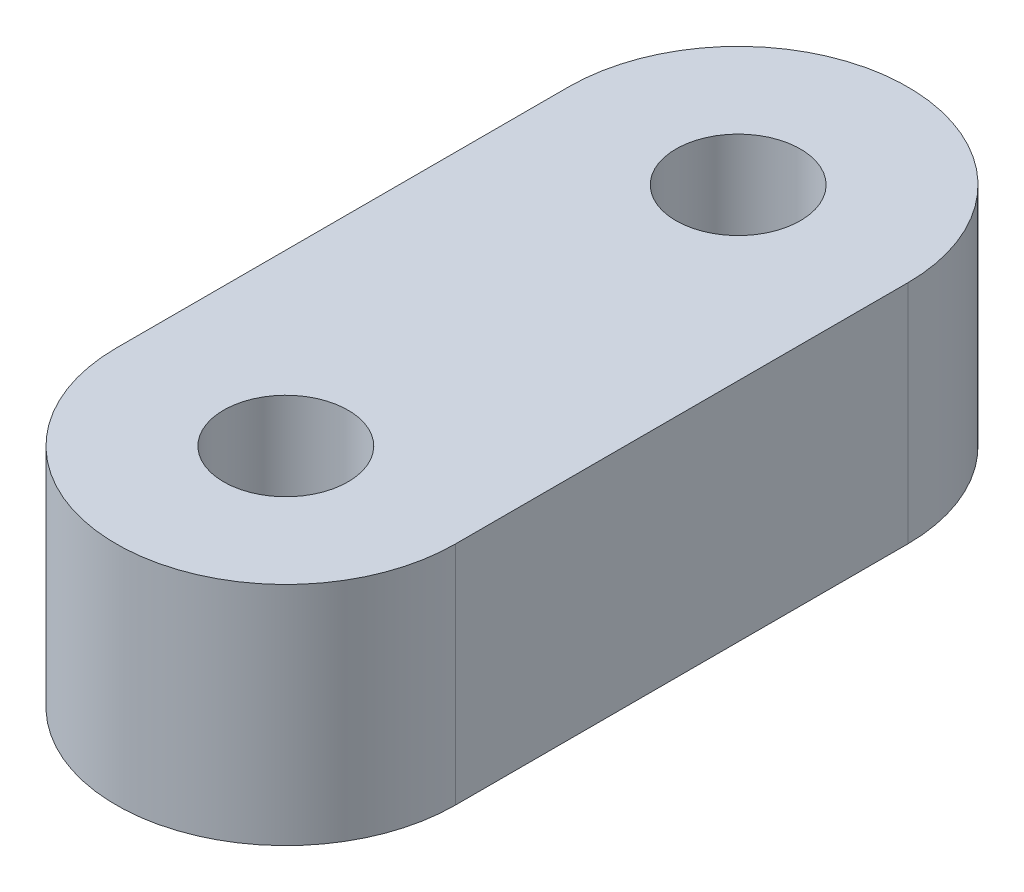
ISO-10303-21;
HEADER;
FILE_DESCRIPTION(('STEP AP214'),'2;1');
FILE_NAME('part.step','',(''),(''),'','','');
FILE_SCHEMA(('AUTOMOTIVE_DESIGN { 1 0 10303 214 1 1 1 1 }'));
ENDSEC;
DATA;
#1=APPLICATION_CONTEXT('core data for automotive mechanical design processes');
#2=APPLICATION_PROTOCOL_DEFINITION('international standard','automotive_design',2000,#1);
#3=PRODUCT_CONTEXT('',#1,'mechanical');
#4=PRODUCT('Part','Part','',(#3));
#5=PRODUCT_RELATED_PRODUCT_CATEGORY('part','',(#4));
#6=PRODUCT_DEFINITION_FORMATION('','',#4);
#7=PRODUCT_DEFINITION_CONTEXT('part definition',#1,'design');
#8=PRODUCT_DEFINITION('design','',#6,#7);
#9=PRODUCT_DEFINITION_SHAPE('','',#8);
#10=(LENGTH_UNIT() NAMED_UNIT(*) SI_UNIT(.MILLI.,.METRE.));
#11=(NAMED_UNIT(*) PLANE_ANGLE_UNIT() SI_UNIT($,.RADIAN.));
#12=(NAMED_UNIT(*) SI_UNIT($,.STERADIAN.) SOLID_ANGLE_UNIT());
#13=UNCERTAINTY_MEASURE_WITH_UNIT(LENGTH_MEASURE(1.E-05),#10,'distance_accuracy_value','');
#14=(GEOMETRIC_REPRESENTATION_CONTEXT(3) GLOBAL_UNCERTAINTY_ASSIGNED_CONTEXT((#13)) GLOBAL_UNIT_ASSIGNED_CONTEXT((#10,
#11,#12)) REPRESENTATION_CONTEXT('',''));
#15=CARTESIAN_POINT('',(0.,0.,0.));
#16=DIRECTION('',(0.,0.,1.));
#17=DIRECTION('',(1.,0.,0.));
#18=AXIS2_PLACEMENT_3D('',#15,#16,#17);
#19=CARTESIAN_POINT('',(-7.5,10.,0.));
#20=DIRECTION('',(1.,0.,0.));
#21=DIRECTION('',(0.,0.,-1.));
#22=AXIS2_PLACEMENT_3D('',#19,#20,#21);
#23=PLANE('',#22);
#24=DIRECTION('',(0.,0.,1.));
#25=VECTOR('',#24,1.);
#26=CARTESIAN_POINT('',(-7.5,0.,0.));
#27=LINE('',#26,#25);
#28=CARTESIAN_POINT('',(-7.5,0.,-20.));
#29=VERTEX_POINT('',#28);
#30=CARTESIAN_POINT('',(-7.5,0.,0.));
#31=VERTEX_POINT('',#30);
#32=EDGE_CURVE('E102',#29,#31,#27,.T.);
#33=ORIENTED_EDGE('',*,*,#32,.T.);
#34=DIRECTION('',(0.,-1.,0.));
#35=VECTOR('',#34,1.);
#36=CARTESIAN_POINT('',(-7.5,10.,0.));
#37=LINE('',#36,#35);
#38=CARTESIAN_POINT('',(-7.5,10.,0.));
#39=VERTEX_POINT('',#38);
#40=EDGE_CURVE('E11',#39,#31,#37,.T.);
#41=ORIENTED_EDGE('',*,*,#40,.F.);
#42=DIRECTION('',(0.,0.,1.));
#43=VECTOR('',#42,1.);
#44=CARTESIAN_POINT('',(-7.5,10.,0.));
#45=LINE('',#44,#43);
#46=CARTESIAN_POINT('',(-7.5,10.,-20.));
#47=VERTEX_POINT('',#46);
#48=EDGE_CURVE('E81',#47,#39,#45,.T.);
#49=ORIENTED_EDGE('',*,*,#48,.F.);
#50=DIRECTION('',(0.,-1.,0.));
#51=VECTOR('',#50,1.);
#52=CARTESIAN_POINT('',(-7.5,10.,-20.));
#53=LINE('',#52,#51);
#54=EDGE_CURVE('E92',#47,#29,#53,.T.);
#55=ORIENTED_EDGE('',*,*,#54,.T.);
#56=EDGE_LOOP('',(#33,#41,#49,#55));
#57=FACE_BOUND('',#56,.T.);
#58=ADVANCED_FACE('F33',(#57),#23,.F.);
#59=CARTESIAN_POINT('',(0.,10.,0.));
#60=DIRECTION('',(0.,-1.,0.));
#61=DIRECTION('',(0.,0.,-1.));
#62=AXIS2_PLACEMENT_3D('',#59,#60,#61);
#63=CYLINDRICAL_SURFACE('',#62,7.5);
#64=CARTESIAN_POINT('',(0.,0.,0.));
#65=DIRECTION('',(0.,1.,0.));
#66=DIRECTION('',(0.,0.,1.));
#67=AXIS2_PLACEMENT_3D('',#64,#65,#66);
#68=CIRCLE('',#67,7.5);
#69=CARTESIAN_POINT('',(7.5,0.,0.));
#70=VERTEX_POINT('',#69);
#71=EDGE_CURVE('E86',#31,#70,#68,.T.);
#72=ORIENTED_EDGE('',*,*,#71,.T.);
#73=DIRECTION('',(0.,-1.,0.));
#74=VECTOR('',#73,1.);
#75=CARTESIAN_POINT('',(7.5,10.,0.));
#76=LINE('',#75,#74);
#77=CARTESIAN_POINT('',(7.5,10.,0.));
#78=VERTEX_POINT('',#77);
#79=EDGE_CURVE('E42',#78,#70,#76,.T.);
#80=ORIENTED_EDGE('',*,*,#79,.F.);
#81=CARTESIAN_POINT('',(0.,10.,0.));
#82=DIRECTION('',(0.,1.,0.));
#83=DIRECTION('',(0.,0.,1.));
#84=AXIS2_PLACEMENT_3D('',#81,#82,#83);
#85=CIRCLE('',#84,7.5);
#86=EDGE_CURVE('E76',#39,#78,#85,.T.);
#87=ORIENTED_EDGE('',*,*,#86,.F.);
#88=ORIENTED_EDGE('',*,*,#40,.T.);
#89=EDGE_LOOP('',(#72,#80,#87,#88));
#90=FACE_BOUND('',#89,.T.);
#91=ADVANCED_FACE('F85',(#90),#63,.T.);
#92=CARTESIAN_POINT('',(7.5,10.,0.));
#93=DIRECTION('',(1.,0.,0.));
#94=DIRECTION('',(0.,0.,-1.));
#95=AXIS2_PLACEMENT_3D('',#92,#93,#94);
#96=PLANE('',#95);
#97=DIRECTION('',(0.,0.,1.));
#98=VECTOR('',#97,1.);
#99=CARTESIAN_POINT('',(7.5,0.,0.));
#100=LINE('',#99,#98);
#101=CARTESIAN_POINT('',(7.5,0.,-20.));
#102=VERTEX_POINT('',#101);
#103=EDGE_CURVE('E106',#102,#70,#100,.T.);
#104=ORIENTED_EDGE('',*,*,#103,.F.);
#105=DIRECTION('',(0.,-1.,0.));
#106=VECTOR('',#105,1.);
#107=CARTESIAN_POINT('',(7.5,10.,-20.));
#108=LINE('',#107,#106);
#109=CARTESIAN_POINT('',(7.5,10.,-20.));
#110=VERTEX_POINT('',#109);
#111=EDGE_CURVE('E66',#110,#102,#108,.T.);
#112=ORIENTED_EDGE('',*,*,#111,.F.);
#113=DIRECTION('',(0.,0.,1.));
#114=VECTOR('',#113,1.);
#115=CARTESIAN_POINT('',(7.5,10.,0.));
#116=LINE('',#115,#114);
#117=EDGE_CURVE('E79',#110,#78,#116,.T.);
#118=ORIENTED_EDGE('',*,*,#117,.T.);
#119=ORIENTED_EDGE('',*,*,#79,.T.);
#120=EDGE_LOOP('',(#104,#112,#118,#119));
#121=FACE_BOUND('',#120,.T.);
#122=ADVANCED_FACE('F90',(#121),#96,.T.);
#123=CARTESIAN_POINT('',(0.,10.,0.));
#124=DIRECTION('',(0.,-1.,0.));
#125=DIRECTION('',(0.,0.,-1.));
#126=AXIS2_PLACEMENT_3D('',#123,#124,#125);
#127=CYLINDRICAL_SURFACE('',#126,2.75);
#128=CARTESIAN_POINT('',(0.,10.,0.));
#129=DIRECTION('',(0.,1.,0.));
#130=DIRECTION('',(0.,0.,1.));
#131=AXIS2_PLACEMENT_3D('',#128,#129,#130);
#132=CIRCLE('',#131,2.75);
#133=CARTESIAN_POINT('',(0.,10.,2.75));
#134=VERTEX_POINT('',#133);
#135=EDGE_CURVE('E144',#134,#134,#132,.T.);
#136=ORIENTED_EDGE('',*,*,#135,.T.);
#137=EDGE_LOOP('',(#136));
#138=FACE_BOUND('',#137,.T.);
#139=CARTESIAN_POINT('',(0.,0.,0.));
#140=DIRECTION('',(0.,1.,0.));
#141=DIRECTION('',(0.,0.,1.));
#142=AXIS2_PLACEMENT_3D('',#139,#140,#141);
#143=CIRCLE('',#142,2.75);
#144=CARTESIAN_POINT('',(0.,0.,2.75));
#145=VERTEX_POINT('',#144);
#146=EDGE_CURVE('E99',#145,#145,#143,.T.);
#147=ORIENTED_EDGE('',*,*,#146,.F.);
#148=EDGE_LOOP('',(#147));
#149=FACE_BOUND('',#148,.T.);
#150=ADVANCED_FACE('F133',(#138,#149),#127,.F.);
#151=CARTESIAN_POINT('',(0.,10.,-20.));
#152=DIRECTION('',(0.,-1.,0.));
#153=DIRECTION('',(0.,0.,-1.));
#154=AXIS2_PLACEMENT_3D('',#151,#152,#153);
#155=CYLINDRICAL_SURFACE('',#154,2.75);
#156=CARTESIAN_POINT('',(0.,10.,-20.));
#157=DIRECTION('',(0.,1.,0.));
#158=DIRECTION('',(0.,0.,1.));
#159=AXIS2_PLACEMENT_3D('',#156,#157,#158);
#160=CIRCLE('',#159,2.75);
#161=CARTESIAN_POINT('',(0.,10.,-17.25));
#162=VERTEX_POINT('',#161);
#163=EDGE_CURVE('E109',#162,#162,#160,.T.);
#164=ORIENTED_EDGE('',*,*,#163,.T.);
#165=EDGE_LOOP('',(#164));
#166=FACE_BOUND('',#165,.T.);
#167=CARTESIAN_POINT('',(0.,0.,-20.));
#168=DIRECTION('',(0.,1.,0.));
#169=DIRECTION('',(0.,0.,1.));
#170=AXIS2_PLACEMENT_3D('',#167,#168,#169);
#171=CIRCLE('',#170,2.75);
#172=CARTESIAN_POINT('',(0.,0.,-17.25));
#173=VERTEX_POINT('',#172);
#174=EDGE_CURVE('E96',#173,#173,#171,.T.);
#175=ORIENTED_EDGE('',*,*,#174,.F.);
#176=EDGE_LOOP('',(#175));
#177=FACE_BOUND('',#176,.T.);
#178=ADVANCED_FACE('F35',(#166,#177),#155,.F.);
#179=CARTESIAN_POINT('',(0.,10.,-20.));
#180=DIRECTION('',(0.,-1.,0.));
#181=DIRECTION('',(0.,0.,-1.));
#182=AXIS2_PLACEMENT_3D('',#179,#180,#181);
#183=CYLINDRICAL_SURFACE('',#182,7.5);
#184=CARTESIAN_POINT('',(0.,0.,-20.));
#185=DIRECTION('',(0.,1.,0.));
#186=DIRECTION('',(0.,0.,1.));
#187=AXIS2_PLACEMENT_3D('',#184,#185,#186);
#188=CIRCLE('',#187,7.5);
#189=EDGE_CURVE('E69',#102,#29,#188,.T.);
#190=ORIENTED_EDGE('',*,*,#189,.T.);
#191=ORIENTED_EDGE('',*,*,#54,.F.);
#192=CARTESIAN_POINT('',(0.,10.,-20.));
#193=DIRECTION('',(0.,1.,0.));
#194=DIRECTION('',(0.,0.,1.));
#195=AXIS2_PLACEMENT_3D('',#192,#193,#194);
#196=CIRCLE('',#195,7.5);
#197=EDGE_CURVE('E50',#110,#47,#196,.T.);
#198=ORIENTED_EDGE('',*,*,#197,.F.);
#199=ORIENTED_EDGE('',*,*,#111,.T.);
#200=EDGE_LOOP('',(#190,#191,#198,#199));
#201=FACE_BOUND('',#200,.T.);
#202=ADVANCED_FACE('F121',(#201),#183,.T.);
#203=CARTESIAN_POINT('',(0.,10.,0.));
#204=DIRECTION('',(0.,1.,0.));
#205=DIRECTION('',(0.,0.,1.));
#206=AXIS2_PLACEMENT_3D('',#203,#204,#205);
#207=PLANE('',#206);
#208=ORIENTED_EDGE('',*,*,#163,.F.);
#209=EDGE_LOOP('',(#208));
#210=FACE_BOUND('',#209,.T.);
#211=ORIENTED_EDGE('',*,*,#135,.F.);
#212=EDGE_LOOP('',(#211));
#213=FACE_BOUND('',#212,.T.);
#214=ORIENTED_EDGE('',*,*,#48,.T.);
#215=ORIENTED_EDGE('',*,*,#86,.T.);
#216=ORIENTED_EDGE('',*,*,#117,.F.);
#217=ORIENTED_EDGE('',*,*,#197,.T.);
#218=EDGE_LOOP('',(#214,#215,#216,#217));
#219=FACE_BOUND('',#218,.T.);
#220=ADVANCED_FACE('F77',(#210,#213,#219),#207,.T.);
#221=CARTESIAN_POINT('',(0.,0.,0.));
#222=DIRECTION('',(0.,1.,0.));
#223=DIRECTION('',(0.,0.,1.));
#224=AXIS2_PLACEMENT_3D('',#221,#222,#223);
#225=PLANE('',#224);
#226=ORIENTED_EDGE('',*,*,#174,.T.);
#227=EDGE_LOOP('',(#226));
#228=FACE_BOUND('',#227,.T.);
#229=ORIENTED_EDGE('',*,*,#146,.T.);
#230=EDGE_LOOP('',(#229));
#231=FACE_BOUND('',#230,.T.);
#232=ORIENTED_EDGE('',*,*,#32,.F.);
#233=ORIENTED_EDGE('',*,*,#189,.F.);
#234=ORIENTED_EDGE('',*,*,#103,.T.);
#235=ORIENTED_EDGE('',*,*,#71,.F.);
#236=EDGE_LOOP('',(#232,#233,#234,#235));
#237=FACE_BOUND('',#236,.T.);
#238=ADVANCED_FACE('F114',(#228,#231,#237),#225,.F.);
#239=CLOSED_SHELL('',(#58,#91,#122,#150,#178,#202,#220,#238));
#240=MANIFOLD_SOLID_BREP('B2',#239);
#241=ADVANCED_BREP_SHAPE_REPRESENTATION('',(#18,#240),#14);
#242=SHAPE_DEFINITION_REPRESENTATION(#9,#241);
ENDSEC;
END-ISO-10303-21;
